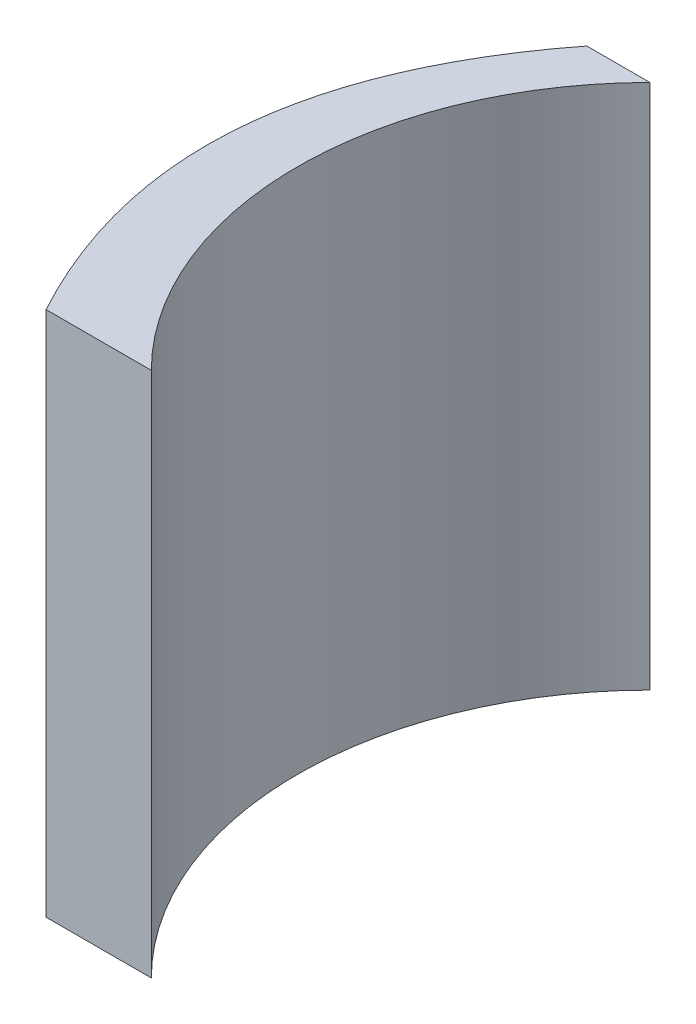
ISO-10303-21;
HEADER;
FILE_DESCRIPTION(('STEP AP214'),'2;1');
FILE_NAME('part.step','',(''),(''),'','','');
FILE_SCHEMA(('AUTOMOTIVE_DESIGN { 1 0 10303 214 1 1 1 1 }'));
ENDSEC;
DATA;
#1=APPLICATION_CONTEXT('core data for automotive mechanical design processes');
#2=APPLICATION_PROTOCOL_DEFINITION('international standard','automotive_design',2000,#1);
#3=PRODUCT_CONTEXT('',#1,'mechanical');
#4=PRODUCT('Part','Part','',(#3));
#5=PRODUCT_RELATED_PRODUCT_CATEGORY('part','',(#4));
#6=PRODUCT_DEFINITION_FORMATION('','',#4);
#7=PRODUCT_DEFINITION_CONTEXT('part definition',#1,'design');
#8=PRODUCT_DEFINITION('design','',#6,#7);
#9=PRODUCT_DEFINITION_SHAPE('','',#8);
#10=(LENGTH_UNIT() NAMED_UNIT(*) SI_UNIT(.MILLI.,.METRE.));
#11=(NAMED_UNIT(*) PLANE_ANGLE_UNIT() SI_UNIT($,.RADIAN.));
#12=(NAMED_UNIT(*) SI_UNIT($,.STERADIAN.) SOLID_ANGLE_UNIT());
#13=UNCERTAINTY_MEASURE_WITH_UNIT(LENGTH_MEASURE(1.E-05),#10,'distance_accuracy_value','');
#14=(GEOMETRIC_REPRESENTATION_CONTEXT(3) GLOBAL_UNCERTAINTY_ASSIGNED_CONTEXT((#13)) GLOBAL_UNIT_ASSIGNED_CONTEXT((#10,
#11,#12)) REPRESENTATION_CONTEXT('',''));
#15=CARTESIAN_POINT('',(0.,0.,0.));
#16=DIRECTION('',(0.,0.,1.));
#17=DIRECTION('',(1.,0.,0.));
#18=AXIS2_PLACEMENT_3D('',#15,#16,#17);
#19=CARTESIAN_POINT('',(0.,50.,-23.6880771697493));
#20=DIRECTION('',(0.,0.,1.));
#21=DIRECTION('',(1.,0.,0.));
#22=AXIS2_PLACEMENT_3D('',#19,#20,#21);
#23=PLANE('',#22);
#24=DIRECTION('',(-1.,0.,0.));
#25=VECTOR('',#24,1.);
#26=CARTESIAN_POINT('',(0.,0.,-23.6880771697493));
#27=LINE('',#26,#25);
#28=CARTESIAN_POINT('',(-23.6880771697493,0.,-23.6880771697493));
#29=VERTEX_POINT('',#28);
#30=CARTESIAN_POINT('',(-29.6880771697493,0.,-23.6880771697493));
#31=VERTEX_POINT('',#30);
#32=EDGE_CURVE('E141',#29,#31,#27,.T.);
#33=ORIENTED_EDGE('',*,*,#32,.T.);
#34=DIRECTION('',(0.,-1.,0.));
#35=VECTOR('',#34,1.);
#36=CARTESIAN_POINT('',(-29.6880771697493,50.,-23.6880771697493));
#37=LINE('',#36,#35);
#38=CARTESIAN_POINT('',(-29.6880771697493,50.,-23.6880771697493));
#39=VERTEX_POINT('',#38);
#40=EDGE_CURVE('E190',#39,#31,#37,.T.);
#41=ORIENTED_EDGE('',*,*,#40,.F.);
#42=DIRECTION('',(-1.,0.,0.));
#43=VECTOR('',#42,1.);
#44=CARTESIAN_POINT('',(0.,50.,-23.6880771697493));
#45=LINE('',#44,#43);
#46=CARTESIAN_POINT('',(-23.6880771697493,50.,-23.6880771697493));
#47=VERTEX_POINT('',#46);
#48=EDGE_CURVE('E143',#47,#39,#45,.T.);
#49=ORIENTED_EDGE('',*,*,#48,.F.);
#50=DIRECTION('',(0.,-1.,0.));
#51=VECTOR('',#50,1.);
#52=CARTESIAN_POINT('',(-23.6880771697493,50.,-23.6880771697493));
#53=LINE('',#52,#51);
#54=EDGE_CURVE('E69',#47,#29,#53,.T.);
#55=ORIENTED_EDGE('',*,*,#54,.T.);
#56=EDGE_LOOP('',(#33,#41,#49,#55));
#57=FACE_BOUND('',#56,.T.);
#58=ADVANCED_FACE('F43',(#57),#23,.F.);
#59=CARTESIAN_POINT('',(-29.6880771697493,50.,-23.6880771697493));
#60=CARTESIAN_POINT('',(-47.2217353331707,50.,-1.18361385183467));
#61=CARTESIAN_POINT('',(-33.6880771697493,50.,23.6880771697493));
#62=B_SPLINE_CURVE_WITH_KNOTS('',2,(#59,#60,#61),.UNSPECIFIED.,.F.,.F.,(3,3),(0.,1.),.UNSPECIFIED.);
#63=DIRECTION('',(0.,-1.,0.));
#64=VECTOR('',#63,1.);
#65=SURFACE_OF_LINEAR_EXTRUSION('',#62,#64);
#66=DIRECTION('',(0.,-1.,0.));
#67=VECTOR('',#66,1.);
#68=CARTESIAN_POINT('',(-33.6880771697493,50.,23.6880771697493));
#69=LINE('',#68,#67);
#70=CARTESIAN_POINT('',(-33.6880771697493,7.5,23.6880771697493));
#71=VERTEX_POINT('',#70);
#72=CARTESIAN_POINT('',(-33.6880771697493,0.,23.6880771697493));
#73=VERTEX_POINT('',#72);
#74=EDGE_CURVE('E216',#71,#73,#69,.T.);
#75=ORIENTED_EDGE('',*,*,#74,.F.);
#76=CARTESIAN_POINT('',(-29.6880771697493,7.5,-23.6880771697493));
#77=CARTESIAN_POINT('',(-47.2217353331707,7.5,-1.18361385183467));
#78=CARTESIAN_POINT('',(-33.6880771697493,7.5,23.6880771697493));
#79=B_SPLINE_CURVE_WITH_KNOTS('',2,(#76,#77,#78),.UNSPECIFIED.,.F.,.F.,(3,3),(0.,1.),.UNSPECIFIED.);
#80=CARTESIAN_POINT('',(-39.4429006357392,7.5,5.68807716974934));
#81=VERTEX_POINT('',#80);
#82=EDGE_CURVE('E11',#71,#81,#79,.F.);
#83=ORIENTED_EDGE('',*,*,#82,.T.);
#84=DIRECTION('',(0.,-1.,0.));
#85=VECTOR('',#84,1.);
#86=CARTESIAN_POINT('',(-39.4429006357392,50.,5.68807716974934));
#87=LINE('',#86,#85);
#88=CARTESIAN_POINT('',(-39.4429006357392,17.5,5.68807716974934));
#89=VERTEX_POINT('',#88);
#90=EDGE_CURVE('E223',#81,#89,#87,.F.);
#91=ORIENTED_EDGE('',*,*,#90,.T.);
#92=CARTESIAN_POINT('',(-29.6880771697493,17.5,-23.6880771697493));
#93=CARTESIAN_POINT('',(-47.2217353331707,17.5,-1.18361385183467));
#94=CARTESIAN_POINT('',(-33.6880771697493,17.5,23.6880771697493));
#95=B_SPLINE_CURVE_WITH_KNOTS('',2,(#92,#93,#94),.UNSPECIFIED.,.F.,.F.,(3,3),(0.,1.),.UNSPECIFIED.);
#96=CARTESIAN_POINT('',(-33.6880771697493,17.5,23.6880771697493));
#97=VERTEX_POINT('',#96);
#98=EDGE_CURVE('E53',#89,#97,#95,.T.);
#99=ORIENTED_EDGE('',*,*,#98,.T.);
#100=CARTESIAN_POINT('',(-33.6880771697493,50.,23.6880771697493));
#101=VERTEX_POINT('',#100);
#102=EDGE_CURVE('E217',#101,#97,#69,.T.);
#103=ORIENTED_EDGE('',*,*,#102,.F.);
#104=EDGE_CURVE('E96',#39,#101,#62,.T.);
#105=ORIENTED_EDGE('',*,*,#104,.F.);
#106=ORIENTED_EDGE('',*,*,#40,.T.);
#107=CARTESIAN_POINT('',(-29.6880771697493,0.,-23.6880771697493));
#108=CARTESIAN_POINT('',(-47.2217353331707,0.,-1.18361385183467));
#109=CARTESIAN_POINT('',(-33.6880771697493,0.,23.6880771697493));
#110=B_SPLINE_CURVE_WITH_KNOTS('',2,(#107,#108,#109),.UNSPECIFIED.,.F.,.F.,(3,3),(0.,1.),.UNSPECIFIED.);
#111=EDGE_CURVE('E193',#31,#73,#110,.T.);
#112=ORIENTED_EDGE('',*,*,#111,.T.);
#113=EDGE_LOOP('',(#75,#83,#91,#99,#103,#105,#106,#112));
#114=FACE_BOUND('',#113,.T.);
#115=ADVANCED_FACE('F157',(#114),#65,.F.);
#116=CARTESIAN_POINT('',(0.,50.,23.6880771697493));
#117=DIRECTION('',(0.,0.,1.));
#118=DIRECTION('',(1.,0.,0.));
#119=AXIS2_PLACEMENT_3D('',#116,#117,#118);
#120=PLANE('',#119);
#121=DIRECTION('',(-1.,0.,0.));
#122=VECTOR('',#121,1.);
#123=CARTESIAN_POINT('',(0.,0.,23.6880771697493));
#124=LINE('',#123,#122);
#125=CARTESIAN_POINT('',(-23.6880771697493,0.,23.6880771697493));
#126=VERTEX_POINT('',#125);
#127=EDGE_CURVE('E197',#126,#73,#124,.T.);
#128=ORIENTED_EDGE('',*,*,#127,.F.);
#129=DIRECTION('',(0.,-1.,0.));
#130=VECTOR('',#129,1.);
#131=CARTESIAN_POINT('',(-23.6880771697493,50.,23.6880771697493));
#132=LINE('',#131,#130);
#133=CARTESIAN_POINT('',(-23.6880771697493,50.,23.6880771697493));
#134=VERTEX_POINT('',#133);
#135=EDGE_CURVE('E213',#134,#126,#132,.T.);
#136=ORIENTED_EDGE('',*,*,#135,.F.);
#137=DIRECTION('',(-1.,0.,0.));
#138=VECTOR('',#137,1.);
#139=CARTESIAN_POINT('',(0.,50.,23.6880771697493));
#140=LINE('',#139,#138);
#141=EDGE_CURVE('E152',#134,#101,#140,.T.);
#142=ORIENTED_EDGE('',*,*,#141,.T.);
#143=ORIENTED_EDGE('',*,*,#102,.T.);
#144=DIRECTION('',(0.,1.,0.));
#145=VECTOR('',#144,1.);
#146=CARTESIAN_POINT('',(-33.6880771697493,17.5,23.6880771697493));
#147=LINE('',#146,#145);
#148=EDGE_CURVE('E118',#71,#97,#147,.T.);
#149=ORIENTED_EDGE('',*,*,#148,.F.);
#150=ORIENTED_EDGE('',*,*,#74,.T.);
#151=EDGE_LOOP('',(#128,#136,#142,#143,#149,#150));
#152=FACE_BOUND('',#151,.T.);
#153=ADVANCED_FACE('F160',(#152),#120,.T.);
#154=CARTESIAN_POINT('',(0.,50.,0.));
#155=DIRECTION('',(0.,-1.,0.));
#156=DIRECTION('',(0.,0.,-1.));
#157=AXIS2_PLACEMENT_3D('',#154,#155,#156);
#158=CYLINDRICAL_SURFACE('',#157,33.5);
#159=CARTESIAN_POINT('',(0.,0.,0.));
#160=DIRECTION('',(0.,1.,0.));
#161=DIRECTION('',(0.,0.,1.));
#162=AXIS2_PLACEMENT_3D('',#159,#160,#161);
#163=CIRCLE('',#162,33.5);
#164=EDGE_CURVE('E146',#29,#126,#163,.T.);
#165=ORIENTED_EDGE('',*,*,#164,.F.);
#166=ORIENTED_EDGE('',*,*,#54,.F.);
#167=CARTESIAN_POINT('',(0.,50.,0.));
#168=DIRECTION('',(0.,1.,0.));
#169=DIRECTION('',(0.,0.,1.));
#170=AXIS2_PLACEMENT_3D('',#167,#168,#169);
#171=CIRCLE('',#170,33.5);
#172=EDGE_CURVE('E199',#47,#134,#171,.T.);
#173=ORIENTED_EDGE('',*,*,#172,.T.);
#174=ORIENTED_EDGE('',*,*,#135,.T.);
#175=EDGE_LOOP('',(#165,#166,#173,#174));
#176=FACE_BOUND('',#175,.T.);
#177=ADVANCED_FACE('F163',(#176),#158,.F.);
#178=CARTESIAN_POINT('',(0.,50.,0.));
#179=DIRECTION('',(0.,1.,0.));
#180=DIRECTION('',(0.,0.,1.));
#181=AXIS2_PLACEMENT_3D('',#178,#179,#180);
#182=PLANE('',#181);
#183=ORIENTED_EDGE('',*,*,#48,.T.);
#184=ORIENTED_EDGE('',*,*,#104,.T.);
#185=ORIENTED_EDGE('',*,*,#141,.F.);
#186=ORIENTED_EDGE('',*,*,#172,.F.);
#187=EDGE_LOOP('',(#183,#184,#185,#186));
#188=FACE_BOUND('',#187,.T.);
#189=ADVANCED_FACE('F167',(#188),#182,.T.);
#190=CARTESIAN_POINT('',(0.,0.,0.));
#191=DIRECTION('',(0.,1.,0.));
#192=DIRECTION('',(0.,0.,1.));
#193=AXIS2_PLACEMENT_3D('',#190,#191,#192);
#194=PLANE('',#193);
#195=ORIENTED_EDGE('',*,*,#32,.F.);
#196=ORIENTED_EDGE('',*,*,#164,.T.);
#197=ORIENTED_EDGE('',*,*,#127,.T.);
#198=ORIENTED_EDGE('',*,*,#111,.F.);
#199=EDGE_LOOP('',(#195,#196,#197,#198));
#200=FACE_BOUND('',#199,.T.);
#201=ADVANCED_FACE('F168',(#200),#194,.F.);
#202=CARTESIAN_POINT('',(-33.6880771697493,7.5,5.68807716974934));
#203=DIRECTION('',(0.,-1.,0.));
#204=DIRECTION('',(1.,0.,0.));
#205=AXIS2_PLACEMENT_3D('',#202,#203,#204);
#206=PLANE('',#205);
#207=DIRECTION('',(0.,0.,1.));
#208=VECTOR('',#207,1.);
#209=CARTESIAN_POINT('',(-33.6880771697493,7.5,5.68807716974934));
#210=LINE('',#209,#208);
#211=CARTESIAN_POINT('',(-33.6880771697493,7.5,5.68807716974934));
#212=VERTEX_POINT('',#211);
#213=EDGE_CURVE('E60',#212,#71,#210,.T.);
#214=ORIENTED_EDGE('',*,*,#213,.F.);
#215=DIRECTION('',(1.,0.,0.));
#216=VECTOR('',#215,1.);
#217=CARTESIAN_POINT('',(-33.6880771697493,7.5,5.68807716974934));
#218=LINE('',#217,#216);
#219=EDGE_CURVE('E122',#81,#212,#218,.T.);
#220=ORIENTED_EDGE('',*,*,#219,.F.);
#221=ORIENTED_EDGE('',*,*,#82,.F.);
#222=EDGE_LOOP('',(#214,#220,#221));
#223=FACE_BOUND('',#222,.T.);
#224=ADVANCED_FACE('F171',(#223),#206,.F.);
#225=CARTESIAN_POINT('',(-33.6880771697493,17.5,5.68807716974934));
#226=DIRECTION('',(0.,1.,0.));
#227=DIRECTION('',(0.,0.,1.));
#228=AXIS2_PLACEMENT_3D('',#225,#226,#227);
#229=PLANE('',#228);
#230=DIRECTION('',(-1.,0.,0.));
#231=VECTOR('',#230,1.);
#232=CARTESIAN_POINT('',(-33.6880771697493,17.5,5.68807716974934));
#233=LINE('',#232,#231);
#234=CARTESIAN_POINT('',(-33.6880771697493,17.5,5.68807716974934));
#235=VERTEX_POINT('',#234);
#236=EDGE_CURVE('E125',#235,#89,#233,.T.);
#237=ORIENTED_EDGE('',*,*,#236,.F.);
#238=DIRECTION('',(0.,0.,1.));
#239=VECTOR('',#238,1.);
#240=CARTESIAN_POINT('',(-33.6880771697493,17.5,5.68807716974934));
#241=LINE('',#240,#239);
#242=EDGE_CURVE('E112',#235,#97,#241,.T.);
#243=ORIENTED_EDGE('',*,*,#242,.T.);
#244=ORIENTED_EDGE('',*,*,#98,.F.);
#245=EDGE_LOOP('',(#237,#243,#244));
#246=FACE_BOUND('',#245,.T.);
#247=ADVANCED_FACE('F126',(#246),#229,.F.);
#248=CARTESIAN_POINT('',(0.,0.,5.68807716974934));
#249=DIRECTION('',(0.,0.,-1.));
#250=DIRECTION('',(-1.,0.,0.));
#251=AXIS2_PLACEMENT_3D('',#248,#249,#250);
#252=PLANE('',#251);
#253=ORIENTED_EDGE('',*,*,#219,.T.);
#254=DIRECTION('',(0.,1.,0.));
#255=VECTOR('',#254,1.);
#256=CARTESIAN_POINT('',(-33.6880771697493,17.5,5.68807716974934));
#257=LINE('',#256,#255);
#258=EDGE_CURVE('E116',#212,#235,#257,.T.);
#259=ORIENTED_EDGE('',*,*,#258,.T.);
#260=ORIENTED_EDGE('',*,*,#236,.T.);
#261=ORIENTED_EDGE('',*,*,#90,.F.);
#262=EDGE_LOOP('',(#253,#259,#260,#261));
#263=FACE_BOUND('',#262,.T.);
#264=ADVANCED_FACE('F131',(#263),#252,.F.);
#265=CARTESIAN_POINT('',(-33.6880771697493,17.5,5.68807716974934));
#266=DIRECTION('',(1.,0.,0.));
#267=DIRECTION('',(0.,0.,-1.));
#268=AXIS2_PLACEMENT_3D('',#265,#266,#267);
#269=PLANE('',#268);
#270=ORIENTED_EDGE('',*,*,#148,.T.);
#271=ORIENTED_EDGE('',*,*,#242,.F.);
#272=ORIENTED_EDGE('',*,*,#258,.F.);
#273=ORIENTED_EDGE('',*,*,#213,.T.);
#274=EDGE_LOOP('',(#270,#271,#272,#273));
#275=FACE_BOUND('',#274,.T.);
#276=ADVANCED_FACE('F114',(#275),#269,.F.);
#277=CLOSED_SHELL('',(#58,#115,#153,#177,#189,#201,#224,#247,#264,#276));
#278=MANIFOLD_SOLID_BREP('B2',#277);
#279=ADVANCED_BREP_SHAPE_REPRESENTATION('',(#18,#278),#14);
#280=SHAPE_DEFINITION_REPRESENTATION(#9,#279);
ENDSEC;
END-ISO-10303-21;
